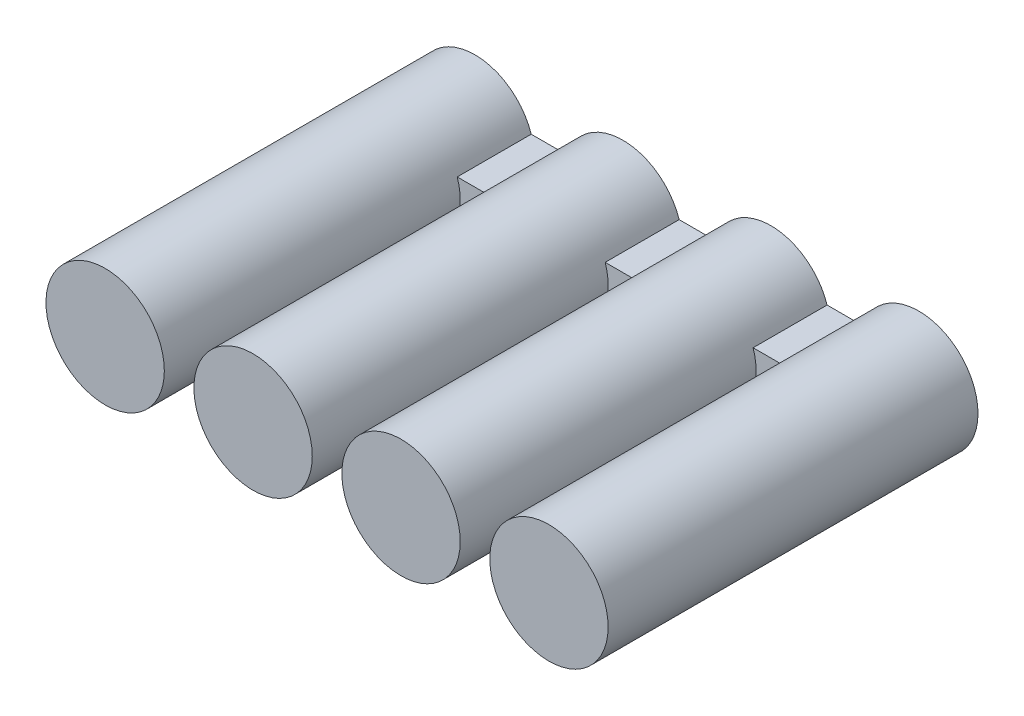
ISO-10303-21;
HEADER;
FILE_DESCRIPTION(('STEP AP214'),'2;1');
FILE_NAME('part.step','',(''),(''),'','','');
FILE_SCHEMA(('AUTOMOTIVE_DESIGN { 1 0 10303 214 1 1 1 1 }'));
ENDSEC;
DATA;
#1=APPLICATION_CONTEXT('core data for automotive mechanical design processes');
#2=APPLICATION_PROTOCOL_DEFINITION('international standard','automotive_design',2000,#1);
#3=PRODUCT_CONTEXT('',#1,'mechanical');
#4=PRODUCT('Part','Part','',(#3));
#5=PRODUCT_RELATED_PRODUCT_CATEGORY('part','',(#4));
#6=PRODUCT_DEFINITION_FORMATION('','',#4);
#7=PRODUCT_DEFINITION_CONTEXT('part definition',#1,'design');
#8=PRODUCT_DEFINITION('design','',#6,#7);
#9=PRODUCT_DEFINITION_SHAPE('','',#8);
#10=(LENGTH_UNIT() NAMED_UNIT(*) SI_UNIT(.MILLI.,.METRE.));
#11=(NAMED_UNIT(*) PLANE_ANGLE_UNIT() SI_UNIT($,.RADIAN.));
#12=(NAMED_UNIT(*) SI_UNIT($,.STERADIAN.) SOLID_ANGLE_UNIT());
#13=UNCERTAINTY_MEASURE_WITH_UNIT(LENGTH_MEASURE(1.E-05),#10,'distance_accuracy_value','');
#14=(GEOMETRIC_REPRESENTATION_CONTEXT(3) GLOBAL_UNCERTAINTY_ASSIGNED_CONTEXT((#13)) GLOBAL_UNIT_ASSIGNED_CONTEXT((#10,
#11,#12)) REPRESENTATION_CONTEXT('',''));
#15=CARTESIAN_POINT('',(0.,0.,0.));
#16=DIRECTION('',(0.,0.,1.));
#17=DIRECTION('',(1.,0.,0.));
#18=AXIS2_PLACEMENT_3D('',#15,#16,#17);
#19=CARTESIAN_POINT('',(0.,1.12925770040399,1.));
#20=DIRECTION('',(0.,-1.,0.));
#21=DIRECTION('',(0.,0.,-1.));
#22=AXIS2_PLACEMENT_3D('',#19,#20,#21);
#23=PLANE('',#22);
#24=DIRECTION('',(-1.,0.,0.));
#25=VECTOR('',#24,1.);
#26=CARTESIAN_POINT('',(0.,1.12925770040399,0.));
#27=LINE('',#26,#25);
#28=CARTESIAN_POINT('',(-0.262011218617374,1.12925770040399,0.));
#29=VERTEX_POINT('',#28);
#30=CARTESIAN_POINT('',(-0.742142803260307,1.12925770040399,0.));
#31=VERTEX_POINT('',#30);
#32=EDGE_CURVE('E205',#29,#31,#27,.T.);
#33=ORIENTED_EDGE('',*,*,#32,.F.);
#34=DIRECTION('',(0.,0.,-1.));
#35=VECTOR('',#34,1.);
#36=CARTESIAN_POINT('',(-0.262011218617374,1.12925770040399,5.));
#37=LINE('',#36,#35);
#38=CARTESIAN_POINT('',(-0.262011218617374,1.12925770040399,1.));
#39=VERTEX_POINT('',#38);
#40=EDGE_CURVE('E165',#29,#39,#37,.F.);
#41=ORIENTED_EDGE('',*,*,#40,.T.);
#42=DIRECTION('',(-1.,0.,0.));
#43=VECTOR('',#42,1.);
#44=CARTESIAN_POINT('',(0.,1.12925770040399,1.));
#45=LINE('',#44,#43);
#46=CARTESIAN_POINT('',(-0.742142803260307,1.12925770040399,1.));
#47=VERTEX_POINT('',#46);
#48=EDGE_CURVE('E202',#39,#47,#45,.T.);
#49=ORIENTED_EDGE('',*,*,#48,.T.);
#50=DIRECTION('',(0.,0.,-1.));
#51=VECTOR('',#50,1.);
#52=CARTESIAN_POINT('',(-0.742142803260307,1.12925770040399,5.));
#53=LINE('',#52,#51);
#54=EDGE_CURVE('E187',#47,#31,#53,.T.);
#55=ORIENTED_EDGE('',*,*,#54,.T.);
#56=EDGE_LOOP('',(#33,#41,#49,#55));
#57=FACE_BOUND('',#56,.T.);
#58=ADVANCED_FACE('F35',(#57),#23,.T.);
#59=CARTESIAN_POINT('',(1.73798878138263,1.12925770040399,1.));
#60=VERTEX_POINT('',#59);
#61=CARTESIAN_POINT('',(1.25785719673969,1.12925770040399,1.));
#62=VERTEX_POINT('',#61);
#63=EDGE_CURVE('E200',#60,#62,#45,.T.);
#64=ORIENTED_EDGE('',*,*,#63,.T.);
#65=DIRECTION('',(0.,0.,-1.));
#66=VECTOR('',#65,1.);
#67=CARTESIAN_POINT('',(1.25785719673969,1.12925770040399,5.));
#68=LINE('',#67,#66);
#69=CARTESIAN_POINT('',(1.25785719673969,1.12925770040399,0.));
#70=VERTEX_POINT('',#69);
#71=EDGE_CURVE('E169',#62,#70,#68,.T.);
#72=ORIENTED_EDGE('',*,*,#71,.T.);
#73=CARTESIAN_POINT('',(1.73798878138263,1.12925770040399,0.));
#74=VERTEX_POINT('',#73);
#75=EDGE_CURVE('E194',#74,#70,#27,.T.);
#76=ORIENTED_EDGE('',*,*,#75,.F.);
#77=DIRECTION('',(0.,0.,-1.));
#78=VECTOR('',#77,1.);
#79=CARTESIAN_POINT('',(1.73798878138263,1.12925770040399,1.));
#80=LINE('',#79,#78);
#81=EDGE_CURVE('E144',#60,#74,#80,.T.);
#82=ORIENTED_EDGE('',*,*,#81,.F.);
#83=EDGE_LOOP('',(#64,#72,#76,#82));
#84=FACE_BOUND('',#83,.T.);
#85=ADVANCED_FACE('F266',(#84),#23,.T.);
#86=CARTESIAN_POINT('',(0.,1.62925770040399,1.));
#87=DIRECTION('',(0.,-1.,0.));
#88=DIRECTION('',(0.,0.,-1.));
#89=AXIS2_PLACEMENT_3D('',#86,#87,#88);
#90=PLANE('',#89);
#91=DIRECTION('',(0.,0.,-1.));
#92=VECTOR('',#91,1.);
#93=CARTESIAN_POINT('',(-0.262011218617374,1.62925770040399,5.));
#94=LINE('',#93,#92);
#95=CARTESIAN_POINT('',(-0.262011218617374,1.62925770040399,0.));
#96=VERTEX_POINT('',#95);
#97=CARTESIAN_POINT('',(-0.262011218617374,1.62925770040399,1.));
#98=VERTEX_POINT('',#97);
#99=EDGE_CURVE('E161',#96,#98,#94,.F.);
#100=ORIENTED_EDGE('',*,*,#99,.F.);
#101=DIRECTION('',(-1.,0.,0.));
#102=VECTOR('',#101,1.);
#103=CARTESIAN_POINT('',(0.,1.62925770040399,0.));
#104=LINE('',#103,#102);
#105=CARTESIAN_POINT('',(-0.742142803260307,1.62925770040399,0.));
#106=VERTEX_POINT('',#105);
#107=EDGE_CURVE('E135',#96,#106,#104,.T.);
#108=ORIENTED_EDGE('',*,*,#107,.T.);
#109=DIRECTION('',(0.,0.,-1.));
#110=VECTOR('',#109,1.);
#111=CARTESIAN_POINT('',(-0.742142803260307,1.62925770040399,5.));
#112=LINE('',#111,#110);
#113=CARTESIAN_POINT('',(-0.742142803260307,1.62925770040399,1.));
#114=VERTEX_POINT('',#113);
#115=EDGE_CURVE('E184',#114,#106,#112,.T.);
#116=ORIENTED_EDGE('',*,*,#115,.F.);
#117=DIRECTION('',(-1.,0.,0.));
#118=VECTOR('',#117,1.);
#119=CARTESIAN_POINT('',(0.,1.62925770040399,1.));
#120=LINE('',#119,#118);
#121=EDGE_CURVE('E197',#98,#114,#120,.T.);
#122=ORIENTED_EDGE('',*,*,#121,.F.);
#123=EDGE_LOOP('',(#100,#108,#116,#122));
#124=FACE_BOUND('',#123,.T.);
#125=ADVANCED_FACE('F245',(#124),#90,.F.);
#126=DIRECTION('',(0.,0.,-1.));
#127=VECTOR('',#126,1.);
#128=CARTESIAN_POINT('',(1.25785719673969,1.62925770040399,5.));
#129=LINE('',#128,#127);
#130=CARTESIAN_POINT('',(1.25785719673969,1.62925770040399,1.));
#131=VERTEX_POINT('',#130);
#132=CARTESIAN_POINT('',(1.25785719673969,1.62925770040399,0.));
#133=VERTEX_POINT('',#132);
#134=EDGE_CURVE('E58',#131,#133,#129,.T.);
#135=ORIENTED_EDGE('',*,*,#134,.F.);
#136=CARTESIAN_POINT('',(1.73798878138263,1.62925770040399,1.));
#137=VERTEX_POINT('',#136);
#138=EDGE_CURVE('E141',#137,#131,#120,.T.);
#139=ORIENTED_EDGE('',*,*,#138,.F.);
#140=DIRECTION('',(0.,0.,-1.));
#141=VECTOR('',#140,1.);
#142=CARTESIAN_POINT('',(1.73798878138263,1.62925770040399,1.));
#143=LINE('',#142,#141);
#144=CARTESIAN_POINT('',(1.73798878138263,1.62925770040399,0.));
#145=VERTEX_POINT('',#144);
#146=EDGE_CURVE('E139',#137,#145,#143,.T.);
#147=ORIENTED_EDGE('',*,*,#146,.T.);
#148=EDGE_CURVE('E125',#145,#133,#104,.T.);
#149=ORIENTED_EDGE('',*,*,#148,.T.);
#150=EDGE_LOOP('',(#135,#139,#147,#149));
#151=FACE_BOUND('',#150,.T.);
#152=ADVANCED_FACE('F140',(#151),#90,.F.);
#153=CARTESIAN_POINT('',(0.,0.,1.));
#154=DIRECTION('',(0.,0.,-1.));
#155=DIRECTION('',(-1.,0.,0.));
#156=AXIS2_PLACEMENT_3D('',#153,#154,#155);
#157=PLANE('',#156);
#158=CARTESIAN_POINT('',(0.497922989061159,1.37925770040399,1.));
#159=DIRECTION('',(0.,0.,-1.));
#160=DIRECTION('',(-1.,0.,0.));
#161=AXIS2_PLACEMENT_3D('',#158,#159,#160);
#162=CIRCLE('',#161,0.8);
#163=EDGE_CURVE('E162',#62,#131,#162,.F.);
#164=ORIENTED_EDGE('',*,*,#163,.F.);
#165=ORIENTED_EDGE('',*,*,#63,.F.);
#166=CARTESIAN_POINT('',(2.49792298906116,1.37925770040399,1.));
#167=DIRECTION('',(0.,0.,-1.));
#168=DIRECTION('',(-1.,0.,0.));
#169=AXIS2_PLACEMENT_3D('',#166,#167,#168);
#170=CIRCLE('',#169,0.8);
#171=EDGE_CURVE('E196',#60,#137,#170,.T.);
#172=ORIENTED_EDGE('',*,*,#171,.T.);
#173=ORIENTED_EDGE('',*,*,#138,.T.);
#174=EDGE_LOOP('',(#164,#165,#172,#173));
#175=FACE_BOUND('',#174,.T.);
#176=ADVANCED_FACE('F253',(#175),#157,.F.);
#177=CARTESIAN_POINT('',(-2.26201121861737,1.12925770040399,0.));
#178=VERTEX_POINT('',#177);
#179=CARTESIAN_POINT('',(-2.74214280326031,1.12925770040399,0.));
#180=VERTEX_POINT('',#179);
#181=EDGE_CURVE('E134',#178,#180,#27,.T.);
#182=ORIENTED_EDGE('',*,*,#181,.F.);
#183=DIRECTION('',(0.,0.,-1.));
#184=VECTOR('',#183,1.);
#185=CARTESIAN_POINT('',(-2.26201121861737,1.12925770040399,5.));
#186=LINE('',#185,#184);
#187=CARTESIAN_POINT('',(-2.26201121861737,1.12925770040399,1.));
#188=VERTEX_POINT('',#187);
#189=EDGE_CURVE('E181',#178,#188,#186,.F.);
#190=ORIENTED_EDGE('',*,*,#189,.T.);
#191=CARTESIAN_POINT('',(-2.74214280326031,1.12925770040399,1.));
#192=VERTEX_POINT('',#191);
#193=EDGE_CURVE('E199',#188,#192,#45,.T.);
#194=ORIENTED_EDGE('',*,*,#193,.T.);
#195=DIRECTION('',(0.,0.,-1.));
#196=VECTOR('',#195,1.);
#197=CARTESIAN_POINT('',(-2.74214280326031,1.12925770040399,1.));
#198=LINE('',#197,#196);
#199=EDGE_CURVE('E206',#192,#180,#198,.T.);
#200=ORIENTED_EDGE('',*,*,#199,.T.);
#201=EDGE_LOOP('',(#182,#190,#194,#200));
#202=FACE_BOUND('',#201,.T.);
#203=ADVANCED_FACE('F223',(#202),#23,.T.);
#204=DIRECTION('',(0.,0.,-1.));
#205=VECTOR('',#204,1.);
#206=CARTESIAN_POINT('',(-2.26201121861737,1.62925770040399,5.));
#207=LINE('',#206,#205);
#208=CARTESIAN_POINT('',(-2.26201121861737,1.62925770040399,0.));
#209=VERTEX_POINT('',#208);
#210=CARTESIAN_POINT('',(-2.26201121861737,1.62925770040399,1.));
#211=VERTEX_POINT('',#210);
#212=EDGE_CURVE('E175',#209,#211,#207,.F.);
#213=ORIENTED_EDGE('',*,*,#212,.F.);
#214=CARTESIAN_POINT('',(-2.74214280326031,1.62925770040399,0.));
#215=VERTEX_POINT('',#214);
#216=EDGE_CURVE('E137',#209,#215,#104,.T.);
#217=ORIENTED_EDGE('',*,*,#216,.T.);
#218=DIRECTION('',(0.,0.,-1.));
#219=VECTOR('',#218,1.);
#220=CARTESIAN_POINT('',(-2.74214280326031,1.62925770040399,1.));
#221=LINE('',#220,#219);
#222=CARTESIAN_POINT('',(-2.74214280326031,1.62925770040399,1.));
#223=VERTEX_POINT('',#222);
#224=EDGE_CURVE('E145',#223,#215,#221,.T.);
#225=ORIENTED_EDGE('',*,*,#224,.F.);
#226=EDGE_CURVE('E193',#211,#223,#120,.T.);
#227=ORIENTED_EDGE('',*,*,#226,.F.);
#228=EDGE_LOOP('',(#213,#217,#225,#227));
#229=FACE_BOUND('',#228,.T.);
#230=ADVANCED_FACE('F248',(#229),#90,.F.);
#231=EDGE_CURVE('E50',#98,#39,#162,.F.);
#232=ORIENTED_EDGE('',*,*,#231,.F.);
#233=ORIENTED_EDGE('',*,*,#121,.T.);
#234=CARTESIAN_POINT('',(-1.50207701093884,1.37925770040399,1.));
#235=DIRECTION('',(0.,0.,-1.));
#236=DIRECTION('',(-1.,0.,0.));
#237=AXIS2_PLACEMENT_3D('',#234,#235,#236);
#238=CIRCLE('',#237,0.8);
#239=EDGE_CURVE('E11',#47,#114,#238,.F.);
#240=ORIENTED_EDGE('',*,*,#239,.F.);
#241=ORIENTED_EDGE('',*,*,#48,.F.);
#242=EDGE_LOOP('',(#232,#233,#240,#241));
#243=FACE_BOUND('',#242,.T.);
#244=ADVANCED_FACE('F232',(#243),#157,.F.);
#245=CARTESIAN_POINT('',(-3.50207701093884,1.37925770040399,5.));
#246=DIRECTION('',(0.,0.,-1.));
#247=DIRECTION('',(-1.,0.,0.));
#248=AXIS2_PLACEMENT_3D('',#245,#246,#247);
#249=CYLINDRICAL_SURFACE('',#248,0.8);
#250=CARTESIAN_POINT('',(-3.50207701093884,1.37925770040399,5.));
#251=DIRECTION('',(0.,0.,1.));
#252=DIRECTION('',(1.,0.,0.));
#253=AXIS2_PLACEMENT_3D('',#250,#251,#252);
#254=CIRCLE('',#253,0.8);
#255=CARTESIAN_POINT('',(-2.70207701093884,1.37925770040399,5.));
#256=VERTEX_POINT('',#255);
#257=EDGE_CURVE('E213',#256,#256,#254,.T.);
#258=ORIENTED_EDGE('',*,*,#257,.F.);
#259=EDGE_LOOP('',(#258));
#260=FACE_BOUND('',#259,.T.);
#261=CARTESIAN_POINT('',(-3.50207701093884,1.37925770040399,0.));
#262=DIRECTION('',(0.,0.,1.));
#263=DIRECTION('',(1.,0.,0.));
#264=AXIS2_PLACEMENT_3D('',#261,#262,#263);
#265=CIRCLE('',#264,0.8);
#266=EDGE_CURVE('E209',#215,#180,#265,.T.);
#267=ORIENTED_EDGE('',*,*,#266,.T.);
#268=ORIENTED_EDGE('',*,*,#199,.F.);
#269=CARTESIAN_POINT('',(-3.50207701093884,1.37925770040399,1.));
#270=DIRECTION('',(0.,0.,-1.));
#271=DIRECTION('',(-1.,0.,0.));
#272=AXIS2_PLACEMENT_3D('',#269,#270,#271);
#273=CIRCLE('',#272,0.799999999999999);
#274=EDGE_CURVE('E190',#223,#192,#273,.T.);
#275=ORIENTED_EDGE('',*,*,#274,.F.);
#276=ORIENTED_EDGE('',*,*,#224,.T.);
#277=EDGE_LOOP('',(#267,#268,#275,#276));
#278=FACE_BOUND('',#277,.T.);
#279=ADVANCED_FACE('F37',(#260,#278),#249,.T.);
#280=CARTESIAN_POINT('',(-3.50207701093884,1.37925770040399,5.));
#281=DIRECTION('',(0.,0.,1.));
#282=DIRECTION('',(1.,0.,0.));
#283=AXIS2_PLACEMENT_3D('',#280,#281,#282);
#284=PLANE('',#283);
#285=ORIENTED_EDGE('',*,*,#257,.T.);
#286=EDGE_LOOP('',(#285));
#287=FACE_BOUND('',#286,.T.);
#288=ADVANCED_FACE('F260',(#287),#284,.T.);
#289=CARTESIAN_POINT('',(-3.50207701093884,1.37925770040399,0.));
#290=DIRECTION('',(0.,0.,1.));
#291=DIRECTION('',(1.,0.,0.));
#292=AXIS2_PLACEMENT_3D('',#289,#290,#291);
#293=PLANE('',#292);
#294=ORIENTED_EDGE('',*,*,#75,.T.);
#295=CARTESIAN_POINT('',(0.497922989061159,1.37925770040399,0.));
#296=DIRECTION('',(0.,0.,1.));
#297=DIRECTION('',(1.,0.,0.));
#298=AXIS2_PLACEMENT_3D('',#295,#296,#297);
#299=CIRCLE('',#298,0.8);
#300=EDGE_CURVE('E153',#29,#70,#299,.T.);
#301=ORIENTED_EDGE('',*,*,#300,.F.);
#302=ORIENTED_EDGE('',*,*,#32,.T.);
#303=CARTESIAN_POINT('',(-1.50207701093884,1.37925770040399,0.));
#304=DIRECTION('',(0.,0.,1.));
#305=DIRECTION('',(1.,0.,0.));
#306=AXIS2_PLACEMENT_3D('',#303,#304,#305);
#307=CIRCLE('',#306,0.8);
#308=EDGE_CURVE('E171',#178,#31,#307,.T.);
#309=ORIENTED_EDGE('',*,*,#308,.F.);
#310=ORIENTED_EDGE('',*,*,#181,.T.);
#311=ORIENTED_EDGE('',*,*,#266,.F.);
#312=ORIENTED_EDGE('',*,*,#216,.F.);
#313=EDGE_CURVE('E176',#106,#209,#307,.T.);
#314=ORIENTED_EDGE('',*,*,#313,.F.);
#315=ORIENTED_EDGE('',*,*,#107,.F.);
#316=EDGE_CURVE('E133',#133,#96,#299,.T.);
#317=ORIENTED_EDGE('',*,*,#316,.F.);
#318=ORIENTED_EDGE('',*,*,#148,.F.);
#319=CARTESIAN_POINT('',(2.49792298906116,1.37925770040399,0.));
#320=DIRECTION('',(0.,0.,1.));
#321=DIRECTION('',(1.,0.,0.));
#322=AXIS2_PLACEMENT_3D('',#319,#320,#321);
#323=CIRCLE('',#322,0.8);
#324=EDGE_CURVE('E130',#74,#145,#323,.T.);
#325=ORIENTED_EDGE('',*,*,#324,.F.);
#326=EDGE_LOOP('',(#294,#301,#302,#309,#310,#311,#312,#314,#315,#317,#318,#325));
#327=FACE_BOUND('',#326,.T.);
#328=ADVANCED_FACE('F128',(#327),#293,.F.);
#329=EDGE_CURVE('E39',#211,#188,#238,.F.);
#330=ORIENTED_EDGE('',*,*,#329,.F.);
#331=ORIENTED_EDGE('',*,*,#226,.T.);
#332=ORIENTED_EDGE('',*,*,#274,.T.);
#333=ORIENTED_EDGE('',*,*,#193,.F.);
#334=EDGE_LOOP('',(#330,#331,#332,#333));
#335=FACE_BOUND('',#334,.T.);
#336=ADVANCED_FACE('F250',(#335),#157,.F.);
#337=CARTESIAN_POINT('',(-1.50207701093884,1.37925770040399,5.));
#338=DIRECTION('',(0.,0.,-1.));
#339=DIRECTION('',(-1.,0.,0.));
#340=AXIS2_PLACEMENT_3D('',#337,#338,#339);
#341=CYLINDRICAL_SURFACE('',#340,0.8);
#342=ORIENTED_EDGE('',*,*,#54,.F.);
#343=ORIENTED_EDGE('',*,*,#239,.T.);
#344=ORIENTED_EDGE('',*,*,#115,.T.);
#345=ORIENTED_EDGE('',*,*,#313,.T.);
#346=ORIENTED_EDGE('',*,*,#212,.T.);
#347=ORIENTED_EDGE('',*,*,#329,.T.);
#348=ORIENTED_EDGE('',*,*,#189,.F.);
#349=ORIENTED_EDGE('',*,*,#308,.T.);
#350=EDGE_LOOP('',(#342,#343,#344,#345,#346,#347,#348,#349));
#351=FACE_BOUND('',#350,.T.);
#352=CARTESIAN_POINT('',(-1.50207701093884,1.37925770040399,5.));
#353=DIRECTION('',(0.,0.,1.));
#354=DIRECTION('',(1.,0.,0.));
#355=AXIS2_PLACEMENT_3D('',#352,#353,#354);
#356=CIRCLE('',#355,0.8);
#357=CARTESIAN_POINT('',(-0.702077010938841,1.37925770040399,5.));
#358=VERTEX_POINT('',#357);
#359=EDGE_CURVE('E172',#358,#358,#356,.T.);
#360=ORIENTED_EDGE('',*,*,#359,.F.);
#361=EDGE_LOOP('',(#360));
#362=FACE_BOUND('',#361,.T.);
#363=ADVANCED_FACE('F235',(#351,#362),#341,.T.);
#364=CARTESIAN_POINT('',(-1.50207701093884,1.37925770040399,5.));
#365=DIRECTION('',(0.,0.,1.));
#366=DIRECTION('',(1.,0.,0.));
#367=AXIS2_PLACEMENT_3D('',#364,#365,#366);
#368=PLANE('',#367);
#369=ORIENTED_EDGE('',*,*,#359,.T.);
#370=EDGE_LOOP('',(#369));
#371=FACE_BOUND('',#370,.T.);
#372=ADVANCED_FACE('F258',(#371),#368,.T.);
#373=CARTESIAN_POINT('',(0.497922989061159,1.37925770040399,5.));
#374=DIRECTION('',(0.,0.,-1.));
#375=DIRECTION('',(-1.,0.,0.));
#376=AXIS2_PLACEMENT_3D('',#373,#374,#375);
#377=CYLINDRICAL_SURFACE('',#376,0.8);
#378=ORIENTED_EDGE('',*,*,#71,.F.);
#379=ORIENTED_EDGE('',*,*,#163,.T.);
#380=ORIENTED_EDGE('',*,*,#134,.T.);
#381=ORIENTED_EDGE('',*,*,#316,.T.);
#382=ORIENTED_EDGE('',*,*,#99,.T.);
#383=ORIENTED_EDGE('',*,*,#231,.T.);
#384=ORIENTED_EDGE('',*,*,#40,.F.);
#385=ORIENTED_EDGE('',*,*,#300,.T.);
#386=EDGE_LOOP('',(#378,#379,#380,#381,#382,#383,#384,#385));
#387=FACE_BOUND('',#386,.T.);
#388=CARTESIAN_POINT('',(0.497922989061159,1.37925770040399,5.));
#389=DIRECTION('',(0.,0.,1.));
#390=DIRECTION('',(1.,0.,0.));
#391=AXIS2_PLACEMENT_3D('',#388,#389,#390);
#392=CIRCLE('',#391,0.8);
#393=CARTESIAN_POINT('',(1.29792298906116,1.37925770040399,5.));
#394=VERTEX_POINT('',#393);
#395=EDGE_CURVE('E156',#394,#394,#392,.T.);
#396=ORIENTED_EDGE('',*,*,#395,.F.);
#397=EDGE_LOOP('',(#396));
#398=FACE_BOUND('',#397,.T.);
#399=ADVANCED_FACE('F242',(#387,#398),#377,.T.);
#400=CARTESIAN_POINT('',(0.497922989061159,1.37925770040399,5.));
#401=DIRECTION('',(0.,0.,1.));
#402=DIRECTION('',(1.,0.,0.));
#403=AXIS2_PLACEMENT_3D('',#400,#401,#402);
#404=PLANE('',#403);
#405=ORIENTED_EDGE('',*,*,#395,.T.);
#406=EDGE_LOOP('',(#405));
#407=FACE_BOUND('',#406,.T.);
#408=ADVANCED_FACE('F353',(#407),#404,.T.);
#409=CARTESIAN_POINT('',(2.49792298906116,1.37925770040399,5.));
#410=DIRECTION('',(0.,0.,-1.));
#411=DIRECTION('',(-1.,0.,0.));
#412=AXIS2_PLACEMENT_3D('',#409,#410,#411);
#413=CYLINDRICAL_SURFACE('',#412,0.8);
#414=ORIENTED_EDGE('',*,*,#81,.T.);
#415=ORIENTED_EDGE('',*,*,#324,.T.);
#416=ORIENTED_EDGE('',*,*,#146,.F.);
#417=ORIENTED_EDGE('',*,*,#171,.F.);
#418=EDGE_LOOP('',(#414,#415,#416,#417));
#419=FACE_BOUND('',#418,.T.);
#420=CARTESIAN_POINT('',(2.49792298906116,1.37925770040399,5.));
#421=DIRECTION('',(0.,0.,1.));
#422=DIRECTION('',(1.,0.,0.));
#423=AXIS2_PLACEMENT_3D('',#420,#421,#422);
#424=CIRCLE('',#423,0.8);
#425=CARTESIAN_POINT('',(3.29792298906116,1.37925770040399,5.));
#426=VERTEX_POINT('',#425);
#427=EDGE_CURVE('E150',#426,#426,#424,.T.);
#428=ORIENTED_EDGE('',*,*,#427,.F.);
#429=EDGE_LOOP('',(#428));
#430=FACE_BOUND('',#429,.T.);
#431=ADVANCED_FACE('F148',(#419,#430),#413,.T.);
#432=CARTESIAN_POINT('',(2.49792298906116,1.37925770040399,5.));
#433=DIRECTION('',(0.,0.,1.));
#434=DIRECTION('',(1.,0.,0.));
#435=AXIS2_PLACEMENT_3D('',#432,#433,#434);
#436=PLANE('',#435);
#437=ORIENTED_EDGE('',*,*,#427,.T.);
#438=EDGE_LOOP('',(#437));
#439=FACE_BOUND('',#438,.T.);
#440=ADVANCED_FACE('F372',(#439),#436,.T.);
#441=CLOSED_SHELL('',(#58,#85,#125,#152,#176,#203,#230,#244,#279,#288,#328,#336,#363,#372,#399,
#408,#431,#440));
#442=MANIFOLD_SOLID_BREP('B2',#441);
#443=ADVANCED_BREP_SHAPE_REPRESENTATION('',(#18,#442),#14);
#444=SHAPE_DEFINITION_REPRESENTATION(#9,#443);
ENDSEC;
END-ISO-10303-21;
